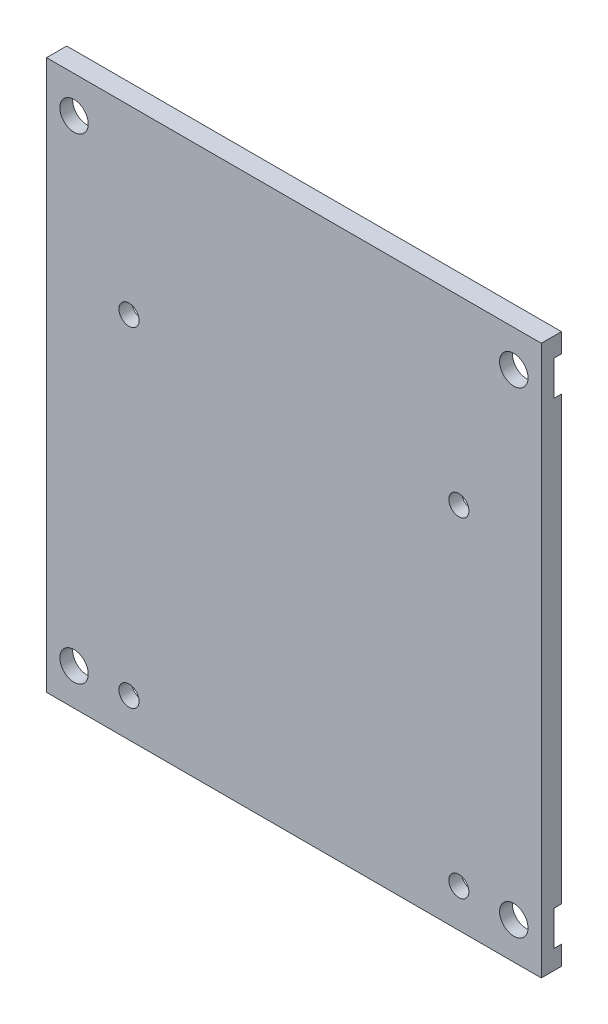
ISO-10303-21;
HEADER;
FILE_DESCRIPTION(('STEP AP214'),'2;1');
FILE_NAME('part.step','',(''),(''),'','','');
FILE_SCHEMA(('AUTOMOTIVE_DESIGN { 1 0 10303 214 1 1 1 1 }'));
ENDSEC;
DATA;
#1=APPLICATION_CONTEXT('core data for automotive mechanical design processes');
#2=APPLICATION_PROTOCOL_DEFINITION('international standard','automotive_design',2000,#1);
#3=PRODUCT_CONTEXT('',#1,'mechanical');
#4=PRODUCT('Part','Part','',(#3));
#5=PRODUCT_RELATED_PRODUCT_CATEGORY('part','',(#4));
#6=PRODUCT_DEFINITION_FORMATION('','',#4);
#7=PRODUCT_DEFINITION_CONTEXT('part definition',#1,'design');
#8=PRODUCT_DEFINITION('design','',#6,#7);
#9=PRODUCT_DEFINITION_SHAPE('','',#8);
#10=(LENGTH_UNIT() NAMED_UNIT(*) SI_UNIT(.MILLI.,.METRE.));
#11=(NAMED_UNIT(*) PLANE_ANGLE_UNIT() SI_UNIT($,.RADIAN.));
#12=(NAMED_UNIT(*) SI_UNIT($,.STERADIAN.) SOLID_ANGLE_UNIT());
#13=UNCERTAINTY_MEASURE_WITH_UNIT(LENGTH_MEASURE(1.E-05),#10,'distance_accuracy_value','');
#14=(GEOMETRIC_REPRESENTATION_CONTEXT(3) GLOBAL_UNCERTAINTY_ASSIGNED_CONTEXT((#13)) GLOBAL_UNIT_ASSIGNED_CONTEXT((#10,
#11,#12)) REPRESENTATION_CONTEXT('',''));
#15=CARTESIAN_POINT('',(0.,0.,0.));
#16=DIRECTION('',(0.,0.,1.));
#17=DIRECTION('',(1.,0.,0.));
#18=AXIS2_PLACEMENT_3D('',#15,#16,#17);
#19=CARTESIAN_POINT('',(-24.,-26.,0.));
#20=DIRECTION('',(0.,0.,1.));
#21=DIRECTION('',(1.,0.,0.));
#22=AXIS2_PLACEMENT_3D('',#19,#20,#21);
#23=CYLINDRICAL_SURFACE('',#22,1.55);
#24=CARTESIAN_POINT('',(-24.,-26.,2.2));
#25=DIRECTION('',(0.,0.,1.));
#26=DIRECTION('',(1.,0.,0.));
#27=AXIS2_PLACEMENT_3D('',#24,#25,#26);
#28=CIRCLE('',#27,1.55);
#29=CARTESIAN_POINT('',(-22.45,-26.,2.2));
#30=VERTEX_POINT('',#29);
#31=EDGE_CURVE('E390',#30,#30,#28,.T.);
#32=ORIENTED_EDGE('',*,*,#31,.T.);
#33=EDGE_LOOP('',(#32));
#34=FACE_BOUND('',#33,.T.);
#35=CARTESIAN_POINT('',(-24.,-26.,0.8));
#36=DIRECTION('',(0.,0.,-1.));
#37=DIRECTION('',(-1.,0.,0.));
#38=AXIS2_PLACEMENT_3D('',#35,#36,#37);
#39=CIRCLE('',#38,1.55);
#40=CARTESIAN_POINT('',(-25.55,-26.,0.8));
#41=VERTEX_POINT('',#40);
#42=EDGE_CURVE('E341',#41,#41,#39,.T.);
#43=ORIENTED_EDGE('',*,*,#42,.T.);
#44=EDGE_LOOP('',(#43));
#45=FACE_BOUND('',#44,.T.);
#46=ADVANCED_FACE('F46',(#34,#45),#23,.F.);
#47=CARTESIAN_POINT('',(-24.,26.,0.));
#48=DIRECTION('',(0.,0.,1.));
#49=DIRECTION('',(1.,0.,0.));
#50=AXIS2_PLACEMENT_3D('',#47,#48,#49);
#51=CYLINDRICAL_SURFACE('',#50,1.55);
#52=CARTESIAN_POINT('',(-24.,26.,2.2));
#53=DIRECTION('',(0.,0.,1.));
#54=DIRECTION('',(1.,0.,0.));
#55=AXIS2_PLACEMENT_3D('',#52,#53,#54);
#56=CIRCLE('',#55,1.55);
#57=CARTESIAN_POINT('',(-22.45,26.,2.2));
#58=VERTEX_POINT('',#57);
#59=EDGE_CURVE('E395',#58,#58,#56,.T.);
#60=ORIENTED_EDGE('',*,*,#59,.T.);
#61=EDGE_LOOP('',(#60));
#62=FACE_BOUND('',#61,.T.);
#63=CARTESIAN_POINT('',(-24.,26.,0.8));
#64=DIRECTION('',(0.,0.,-1.));
#65=DIRECTION('',(-1.,0.,0.));
#66=AXIS2_PLACEMENT_3D('',#63,#64,#65);
#67=CIRCLE('',#66,1.55);
#68=CARTESIAN_POINT('',(-25.55,26.,0.8));
#69=VERTEX_POINT('',#68);
#70=EDGE_CURVE('E351',#69,#69,#67,.T.);
#71=ORIENTED_EDGE('',*,*,#70,.T.);
#72=EDGE_LOOP('',(#71));
#73=FACE_BOUND('',#72,.T.);
#74=ADVANCED_FACE('F429',(#62,#73),#51,.F.);
#75=CARTESIAN_POINT('',(24.,-26.,0.));
#76=DIRECTION('',(0.,0.,1.));
#77=DIRECTION('',(1.,0.,0.));
#78=AXIS2_PLACEMENT_3D('',#75,#76,#77);
#79=CYLINDRICAL_SURFACE('',#78,1.55);
#80=CARTESIAN_POINT('',(24.,-26.,2.2));
#81=DIRECTION('',(0.,0.,1.));
#82=DIRECTION('',(-1.,0.,0.));
#83=AXIS2_PLACEMENT_3D('',#80,#81,#82);
#84=CIRCLE('',#83,1.55);
#85=CARTESIAN_POINT('',(22.45,-26.,2.2));
#86=VERTEX_POINT('',#85);
#87=EDGE_CURVE('E399',#86,#86,#84,.T.);
#88=ORIENTED_EDGE('',*,*,#87,.T.);
#89=EDGE_LOOP('',(#88));
#90=FACE_BOUND('',#89,.T.);
#91=CARTESIAN_POINT('',(24.,-26.,0.8));
#92=DIRECTION('',(0.,0.,-1.));
#93=DIRECTION('',(-1.,0.,0.));
#94=AXIS2_PLACEMENT_3D('',#91,#92,#93);
#95=CIRCLE('',#94,1.55);
#96=CARTESIAN_POINT('',(22.45,-26.,0.8));
#97=VERTEX_POINT('',#96);
#98=EDGE_CURVE('E264',#97,#97,#95,.T.);
#99=ORIENTED_EDGE('',*,*,#98,.T.);
#100=EDGE_LOOP('',(#99));
#101=FACE_BOUND('',#100,.T.);
#102=ADVANCED_FACE('F435',(#90,#101),#79,.F.);
#103=CARTESIAN_POINT('',(24.,26.,0.));
#104=DIRECTION('',(0.,0.,1.));
#105=DIRECTION('',(1.,0.,0.));
#106=AXIS2_PLACEMENT_3D('',#103,#104,#105);
#107=CYLINDRICAL_SURFACE('',#106,1.55);
#108=CARTESIAN_POINT('',(24.,26.,2.2));
#109=DIRECTION('',(0.,0.,1.));
#110=DIRECTION('',(-1.,0.,0.));
#111=AXIS2_PLACEMENT_3D('',#108,#109,#110);
#112=CIRCLE('',#111,1.55);
#113=CARTESIAN_POINT('',(22.45,26.,2.2));
#114=VERTEX_POINT('',#113);
#115=EDGE_CURVE('E389',#114,#114,#112,.T.);
#116=ORIENTED_EDGE('',*,*,#115,.T.);
#117=EDGE_LOOP('',(#116));
#118=FACE_BOUND('',#117,.T.);
#119=CARTESIAN_POINT('',(24.,26.,0.8));
#120=DIRECTION('',(0.,0.,-1.));
#121=DIRECTION('',(-1.,0.,0.));
#122=AXIS2_PLACEMENT_3D('',#119,#120,#121);
#123=CIRCLE('',#122,1.55);
#124=CARTESIAN_POINT('',(22.45,26.,0.8));
#125=VERTEX_POINT('',#124);
#126=EDGE_CURVE('E168',#125,#125,#123,.T.);
#127=ORIENTED_EDGE('',*,*,#126,.T.);
#128=EDGE_LOOP('',(#127));
#129=FACE_BOUND('',#128,.T.);
#130=ADVANCED_FACE('F444',(#118,#129),#107,.F.);
#131=CARTESIAN_POINT('',(-18.,-25.8,2.2));
#132=DIRECTION('',(0.,0.,-1.));
#133=DIRECTION('',(-1.,0.,0.));
#134=AXIS2_PLACEMENT_3D('',#131,#132,#133);
#135=CYLINDRICAL_SURFACE('',#134,1.1);
#136=CARTESIAN_POINT('',(-18.,-25.8,2.2));
#137=DIRECTION('',(0.,0.,1.));
#138=DIRECTION('',(1.,0.,0.));
#139=AXIS2_PLACEMENT_3D('',#136,#137,#138);
#140=CIRCLE('',#139,1.1);
#141=CARTESIAN_POINT('',(-16.9,-25.8,2.2));
#142=VERTEX_POINT('',#141);
#143=EDGE_CURVE('E183',#142,#142,#140,.T.);
#144=ORIENTED_EDGE('',*,*,#143,.T.);
#145=EDGE_LOOP('',(#144));
#146=FACE_BOUND('',#145,.T.);
#147=CARTESIAN_POINT('',(-18.,-25.8,0.8));
#148=DIRECTION('',(0.,0.,-1.));
#149=DIRECTION('',(-1.,0.,0.));
#150=AXIS2_PLACEMENT_3D('',#147,#148,#149);
#151=CIRCLE('',#150,1.1);
#152=CARTESIAN_POINT('',(-19.1,-25.8,0.8));
#153=VERTEX_POINT('',#152);
#154=EDGE_CURVE('E242',#153,#153,#151,.T.);
#155=ORIENTED_EDGE('',*,*,#154,.T.);
#156=EDGE_LOOP('',(#155));
#157=FACE_BOUND('',#156,.T.);
#158=ADVANCED_FACE('F447',(#146,#157),#135,.F.);
#159=CARTESIAN_POINT('',(18.,-25.8,2.2));
#160=DIRECTION('',(0.,0.,-1.));
#161=DIRECTION('',(-1.,0.,0.));
#162=AXIS2_PLACEMENT_3D('',#159,#160,#161);
#163=CYLINDRICAL_SURFACE('',#162,1.1);
#164=CARTESIAN_POINT('',(18.,-25.8,2.2));
#165=DIRECTION('',(0.,0.,1.));
#166=DIRECTION('',(1.,0.,0.));
#167=AXIS2_PLACEMENT_3D('',#164,#165,#166);
#168=CIRCLE('',#167,1.1);
#169=CARTESIAN_POINT('',(19.1,-25.8,2.2));
#170=VERTEX_POINT('',#169);
#171=EDGE_CURVE('E189',#170,#170,#168,.T.);
#172=ORIENTED_EDGE('',*,*,#171,.T.);
#173=EDGE_LOOP('',(#172));
#174=FACE_BOUND('',#173,.T.);
#175=CARTESIAN_POINT('',(18.,-25.8,0.8));
#176=DIRECTION('',(0.,0.,-1.));
#177=DIRECTION('',(-1.,0.,0.));
#178=AXIS2_PLACEMENT_3D('',#175,#176,#177);
#179=CIRCLE('',#178,1.1);
#180=CARTESIAN_POINT('',(16.9,-25.8,0.8));
#181=VERTEX_POINT('',#180);
#182=EDGE_CURVE('E238',#181,#181,#179,.T.);
#183=ORIENTED_EDGE('',*,*,#182,.T.);
#184=EDGE_LOOP('',(#183));
#185=FACE_BOUND('',#184,.T.);
#186=ADVANCED_FACE('F484',(#174,#185),#163,.F.);
#187=CARTESIAN_POINT('',(-18.,10.2,2.2));
#188=DIRECTION('',(0.,0.,-1.));
#189=DIRECTION('',(-1.,0.,0.));
#190=AXIS2_PLACEMENT_3D('',#187,#188,#189);
#191=CYLINDRICAL_SURFACE('',#190,1.1);
#192=CARTESIAN_POINT('',(-18.,10.2,2.2));
#193=DIRECTION('',(0.,0.,1.));
#194=DIRECTION('',(1.,0.,0.));
#195=AXIS2_PLACEMENT_3D('',#192,#193,#194);
#196=CIRCLE('',#195,1.1);
#197=CARTESIAN_POINT('',(-16.9,10.2,2.2));
#198=VERTEX_POINT('',#197);
#199=EDGE_CURVE('E299',#198,#198,#196,.T.);
#200=ORIENTED_EDGE('',*,*,#199,.T.);
#201=EDGE_LOOP('',(#200));
#202=FACE_BOUND('',#201,.T.);
#203=CARTESIAN_POINT('',(-18.,10.2,0.8));
#204=DIRECTION('',(0.,0.,-1.));
#205=DIRECTION('',(-1.,0.,0.));
#206=AXIS2_PLACEMENT_3D('',#203,#204,#205);
#207=CIRCLE('',#206,1.1);
#208=CARTESIAN_POINT('',(-19.1,10.2,0.8));
#209=VERTEX_POINT('',#208);
#210=EDGE_CURVE('E233',#209,#209,#207,.T.);
#211=ORIENTED_EDGE('',*,*,#210,.T.);
#212=EDGE_LOOP('',(#211));
#213=FACE_BOUND('',#212,.T.);
#214=ADVANCED_FACE('F480',(#202,#213),#191,.F.);
#215=CARTESIAN_POINT('',(18.,10.2,2.2));
#216=DIRECTION('',(0.,0.,-1.));
#217=DIRECTION('',(-1.,0.,0.));
#218=AXIS2_PLACEMENT_3D('',#215,#216,#217);
#219=CYLINDRICAL_SURFACE('',#218,1.1);
#220=CARTESIAN_POINT('',(18.,10.2,2.2));
#221=DIRECTION('',(0.,0.,1.));
#222=DIRECTION('',(1.,0.,0.));
#223=AXIS2_PLACEMENT_3D('',#220,#221,#222);
#224=CIRCLE('',#223,1.1);
#225=CARTESIAN_POINT('',(19.1,10.2,2.2));
#226=VERTEX_POINT('',#225);
#227=EDGE_CURVE('E246',#226,#226,#224,.T.);
#228=ORIENTED_EDGE('',*,*,#227,.T.);
#229=EDGE_LOOP('',(#228));
#230=FACE_BOUND('',#229,.T.);
#231=CARTESIAN_POINT('',(18.,10.2,0.8));
#232=DIRECTION('',(0.,0.,-1.));
#233=DIRECTION('',(-1.,0.,0.));
#234=AXIS2_PLACEMENT_3D('',#231,#232,#233);
#235=CIRCLE('',#234,1.1);
#236=CARTESIAN_POINT('',(16.9,10.2,0.8));
#237=VERTEX_POINT('',#236);
#238=EDGE_CURVE('E229',#237,#237,#235,.T.);
#239=ORIENTED_EDGE('',*,*,#238,.T.);
#240=EDGE_LOOP('',(#239));
#241=FACE_BOUND('',#240,.T.);
#242=ADVANCED_FACE('F424',(#230,#241),#219,.F.);
#243=CARTESIAN_POINT('',(0.,0.,2.2));
#244=DIRECTION('',(0.,0.,1.));
#245=DIRECTION('',(1.,0.,0.));
#246=AXIS2_PLACEMENT_3D('',#243,#244,#245);
#247=PLANE('',#246);
#248=ORIENTED_EDGE('',*,*,#115,.F.);
#249=EDGE_LOOP('',(#248));
#250=FACE_BOUND('',#249,.T.);
#251=ORIENTED_EDGE('',*,*,#87,.F.);
#252=EDGE_LOOP('',(#251));
#253=FACE_BOUND('',#252,.T.);
#254=ORIENTED_EDGE('',*,*,#59,.F.);
#255=EDGE_LOOP('',(#254));
#256=FACE_BOUND('',#255,.T.);
#257=ORIENTED_EDGE('',*,*,#31,.F.);
#258=EDGE_LOOP('',(#257));
#259=FACE_BOUND('',#258,.T.);
#260=ORIENTED_EDGE('',*,*,#199,.F.);
#261=EDGE_LOOP('',(#260));
#262=FACE_BOUND('',#261,.T.);
#263=ORIENTED_EDGE('',*,*,#143,.F.);
#264=EDGE_LOOP('',(#263));
#265=FACE_BOUND('',#264,.T.);
#266=DIRECTION('',(0.,1.,0.));
#267=VECTOR('',#266,1.);
#268=CARTESIAN_POINT('',(27.,30.,2.2));
#269=LINE('',#268,#267);
#270=CARTESIAN_POINT('',(27.,-30.,2.2));
#271=VERTEX_POINT('',#270);
#272=CARTESIAN_POINT('',(27.,30.,2.2));
#273=VERTEX_POINT('',#272);
#274=EDGE_CURVE('E213',#271,#273,#269,.T.);
#275=ORIENTED_EDGE('',*,*,#274,.T.);
#276=DIRECTION('',(-1.,0.,0.));
#277=VECTOR('',#276,1.);
#278=CARTESIAN_POINT('',(-27.,30.,2.2));
#279=LINE('',#278,#277);
#280=CARTESIAN_POINT('',(-27.,30.,2.2));
#281=VERTEX_POINT('',#280);
#282=EDGE_CURVE('E309',#273,#281,#279,.T.);
#283=ORIENTED_EDGE('',*,*,#282,.T.);
#284=DIRECTION('',(0.,-1.,0.));
#285=VECTOR('',#284,1.);
#286=CARTESIAN_POINT('',(-27.,30.,2.2));
#287=LINE('',#286,#285);
#288=CARTESIAN_POINT('',(-27.,-30.,2.2));
#289=VERTEX_POINT('',#288);
#290=EDGE_CURVE('E312',#281,#289,#287,.T.);
#291=ORIENTED_EDGE('',*,*,#290,.T.);
#292=DIRECTION('',(1.,0.,0.));
#293=VECTOR('',#292,1.);
#294=CARTESIAN_POINT('',(-27.,-30.,2.2));
#295=LINE('',#294,#293);
#296=EDGE_CURVE('E218',#289,#271,#295,.T.);
#297=ORIENTED_EDGE('',*,*,#296,.T.);
#298=EDGE_LOOP('',(#275,#283,#291,#297));
#299=FACE_BOUND('',#298,.T.);
#300=ORIENTED_EDGE('',*,*,#171,.F.);
#301=EDGE_LOOP('',(#300));
#302=FACE_BOUND('',#301,.T.);
#303=ORIENTED_EDGE('',*,*,#227,.F.);
#304=EDGE_LOOP('',(#303));
#305=FACE_BOUND('',#304,.T.);
#306=ADVANCED_FACE('F318',(#250,#253,#256,#259,#262,#265,#299,#302,#305),#247,.T.);
#307=CARTESIAN_POINT('',(0.,0.,0.));
#308=DIRECTION('',(0.,0.,1.));
#309=DIRECTION('',(1.,0.,0.));
#310=AXIS2_PLACEMENT_3D('',#307,#308,#309);
#311=PLANE('',#310);
#312=CARTESIAN_POINT('',(-18.,10.2,0.));
#313=DIRECTION('',(0.,0.,-1.));
#314=DIRECTION('',(-1.,0.,0.));
#315=AXIS2_PLACEMENT_3D('',#312,#313,#314);
#316=CIRCLE('',#315,3.);
#317=CARTESIAN_POINT('',(-21.,10.2,0.));
#318=VERTEX_POINT('',#317);
#319=EDGE_CURVE('E283',#318,#318,#316,.T.);
#320=ORIENTED_EDGE('',*,*,#319,.F.);
#321=EDGE_LOOP('',(#320));
#322=FACE_BOUND('',#321,.T.);
#323=DIRECTION('',(0.,1.,0.));
#324=VECTOR('',#323,1.);
#325=CARTESIAN_POINT('',(27.,30.,0.));
#326=LINE('',#325,#324);
#327=CARTESIAN_POINT('',(27.,-24.1019747103897,0.));
#328=VERTEX_POINT('',#327);
#329=CARTESIAN_POINT('',(27.,24.1019747103898,0.));
#330=VERTEX_POINT('',#329);
#331=EDGE_CURVE('E182',#328,#330,#326,.T.);
#332=ORIENTED_EDGE('',*,*,#331,.F.);
#333=CARTESIAN_POINT('',(24.,-26.,0.));
#334=DIRECTION('',(0.,0.,-1.));
#335=DIRECTION('',(-1.,0.,0.));
#336=AXIS2_PLACEMENT_3D('',#333,#334,#335);
#337=CIRCLE('',#336,3.55);
#338=CARTESIAN_POINT('',(20.7057534004929,-24.6769582993587,0.));
#339=VERTEX_POINT('',#338);
#340=EDGE_CURVE('E258',#339,#328,#337,.T.);
#341=ORIENTED_EDGE('',*,*,#340,.F.);
#342=CARTESIAN_POINT('',(18.,-25.8,0.));
#343=DIRECTION('',(0.,0.,-1.));
#344=DIRECTION('',(-1.,0.,0.));
#345=AXIS2_PLACEMENT_3D('',#342,#343,#344);
#346=CIRCLE('',#345,2.92956039802186);
#347=CARTESIAN_POINT('',(20.624960937852,-27.1007321785861,0.));
#348=VERTEX_POINT('',#347);
#349=EDGE_CURVE('E261',#348,#339,#346,.T.);
#350=ORIENTED_EDGE('',*,*,#349,.F.);
#351=CARTESIAN_POINT('',(27.,-27.8980252896102,0.));
#352=VERTEX_POINT('',#351);
#353=EDGE_CURVE('E265',#352,#348,#337,.T.);
#354=ORIENTED_EDGE('',*,*,#353,.F.);
#355=CARTESIAN_POINT('',(27.,-30.,0.));
#356=VERTEX_POINT('',#355);
#357=EDGE_CURVE('E185',#356,#352,#326,.T.);
#358=ORIENTED_EDGE('',*,*,#357,.F.);
#359=DIRECTION('',(1.,0.,0.));
#360=VECTOR('',#359,1.);
#361=CARTESIAN_POINT('',(-27.,-30.,0.));
#362=LINE('',#361,#360);
#363=CARTESIAN_POINT('',(-27.,-30.,0.));
#364=VERTEX_POINT('',#363);
#365=EDGE_CURVE('E210',#364,#356,#362,.T.);
#366=ORIENTED_EDGE('',*,*,#365,.F.);
#367=DIRECTION('',(0.,-1.,0.));
#368=VECTOR('',#367,1.);
#369=CARTESIAN_POINT('',(-27.,30.,0.));
#370=LINE('',#369,#368);
#371=CARTESIAN_POINT('',(-27.,-27.8980252896103,0.));
#372=VERTEX_POINT('',#371);
#373=EDGE_CURVE('E199',#372,#364,#370,.T.);
#374=ORIENTED_EDGE('',*,*,#373,.F.);
#375=CARTESIAN_POINT('',(-24.,-26.,0.));
#376=DIRECTION('',(0.,0.,-1.));
#377=DIRECTION('',(-1.,0.,0.));
#378=AXIS2_PLACEMENT_3D('',#375,#376,#377);
#379=CIRCLE('',#378,3.55);
#380=CARTESIAN_POINT('',(-20.6566719898302,-27.1935903050939,0.));
#381=VERTEX_POINT('',#380);
#382=EDGE_CURVE('E507',#381,#372,#379,.T.);
#383=ORIENTED_EDGE('',*,*,#382,.F.);
#384=CARTESIAN_POINT('',(-18.,-25.8,0.));
#385=DIRECTION('',(0.,0.,-1.));
#386=DIRECTION('',(-1.,0.,0.));
#387=AXIS2_PLACEMENT_3D('',#384,#385,#386);
#388=CIRCLE('',#387,3.);
#389=CARTESIAN_POINT('',(-20.7435777327003,-24.5864180189905,0.));
#390=VERTEX_POINT('',#389);
#391=EDGE_CURVE('E285',#390,#381,#388,.T.);
#392=ORIENTED_EDGE('',*,*,#391,.F.);
#393=CARTESIAN_POINT('',(-27.,-24.1019747103898,0.));
#394=VERTEX_POINT('',#393);
#395=EDGE_CURVE('E502',#394,#390,#379,.T.);
#396=ORIENTED_EDGE('',*,*,#395,.F.);
#397=CARTESIAN_POINT('',(-27.,24.1019747103898,0.));
#398=VERTEX_POINT('',#397);
#399=EDGE_CURVE('E204',#398,#394,#370,.T.);
#400=ORIENTED_EDGE('',*,*,#399,.F.);
#401=CARTESIAN_POINT('',(-24.,26.,0.));
#402=DIRECTION('',(0.,0.,-1.));
#403=DIRECTION('',(-1.,0.,0.));
#404=AXIS2_PLACEMENT_3D('',#401,#402,#403);
#405=CIRCLE('',#404,3.55);
#406=CARTESIAN_POINT('',(-27.,27.8980252896102,0.));
#407=VERTEX_POINT('',#406);
#408=EDGE_CURVE('E505',#407,#398,#405,.T.);
#409=ORIENTED_EDGE('',*,*,#408,.F.);
#410=CARTESIAN_POINT('',(-27.,30.,0.));
#411=VERTEX_POINT('',#410);
#412=EDGE_CURVE('E206',#411,#407,#370,.T.);
#413=ORIENTED_EDGE('',*,*,#412,.F.);
#414=DIRECTION('',(-1.,0.,0.));
#415=VECTOR('',#414,1.);
#416=CARTESIAN_POINT('',(-27.,30.,0.));
#417=LINE('',#416,#415);
#418=CARTESIAN_POINT('',(27.,30.,0.));
#419=VERTEX_POINT('',#418);
#420=EDGE_CURVE('E179',#419,#411,#417,.T.);
#421=ORIENTED_EDGE('',*,*,#420,.F.);
#422=CARTESIAN_POINT('',(27.,27.8980252896102,0.));
#423=VERTEX_POINT('',#422);
#424=EDGE_CURVE('E173',#423,#419,#326,.T.);
#425=ORIENTED_EDGE('',*,*,#424,.F.);
#426=CARTESIAN_POINT('',(24.,26.,0.));
#427=DIRECTION('',(0.,0.,-1.));
#428=DIRECTION('',(-1.,0.,0.));
#429=AXIS2_PLACEMENT_3D('',#426,#427,#428);
#430=CIRCLE('',#429,3.55);
#431=EDGE_CURVE('E159',#330,#423,#430,.T.);
#432=ORIENTED_EDGE('',*,*,#431,.F.);
#433=EDGE_LOOP('',(#332,#341,#350,#354,#358,#366,#374,#383,#392,#396,#400,#409,#413,#421,#425,#432));
#434=FACE_BOUND('',#433,.T.);
#435=CARTESIAN_POINT('',(18.,10.2,0.));
#436=DIRECTION('',(0.,0.,-1.));
#437=DIRECTION('',(-1.,0.,0.));
#438=AXIS2_PLACEMENT_3D('',#435,#436,#437);
#439=CIRCLE('',#438,3.);
#440=CARTESIAN_POINT('',(15.,10.2,0.));
#441=VERTEX_POINT('',#440);
#442=EDGE_CURVE('E292',#441,#441,#439,.T.);
#443=ORIENTED_EDGE('',*,*,#442,.F.);
#444=EDGE_LOOP('',(#443));
#445=FACE_BOUND('',#444,.T.);
#446=ADVANCED_FACE('F176',(#322,#434,#445),#311,.F.);
#447=CARTESIAN_POINT('',(27.,30.,2.2));
#448=DIRECTION('',(-1.,0.,0.));
#449=DIRECTION('',(0.,-1.,0.));
#450=AXIS2_PLACEMENT_3D('',#447,#448,#449);
#451=PLANE('',#450);
#452=DIRECTION('',(0.,-1.,0.));
#453=VECTOR('',#452,1.);
#454=CARTESIAN_POINT('',(27.,30.,0.8));
#455=LINE('',#454,#453);
#456=CARTESIAN_POINT('',(27.,-24.1019747103897,0.8));
#457=VERTEX_POINT('',#456);
#458=CARTESIAN_POINT('',(27.,-27.8980252896102,0.8));
#459=VERTEX_POINT('',#458);
#460=EDGE_CURVE('E356',#457,#459,#455,.T.);
#461=ORIENTED_EDGE('',*,*,#460,.F.);
#462=DIRECTION('',(0.,0.,-1.));
#463=VECTOR('',#462,1.);
#464=CARTESIAN_POINT('',(27.,-24.1019747103897,0.8));
#465=LINE('',#464,#463);
#466=EDGE_CURVE('E255',#457,#328,#465,.T.);
#467=ORIENTED_EDGE('',*,*,#466,.T.);
#468=ORIENTED_EDGE('',*,*,#331,.T.);
#469=DIRECTION('',(0.,0.,-1.));
#470=VECTOR('',#469,1.);
#471=CARTESIAN_POINT('',(27.,24.1019747103898,0.8));
#472=LINE('',#471,#470);
#473=CARTESIAN_POINT('',(27.,24.1019747103898,0.8));
#474=VERTEX_POINT('',#473);
#475=EDGE_CURVE('E55',#330,#474,#472,.F.);
#476=ORIENTED_EDGE('',*,*,#475,.T.);
#477=DIRECTION('',(0.,-1.,0.));
#478=VECTOR('',#477,1.);
#479=CARTESIAN_POINT('',(27.,30.,0.8));
#480=LINE('',#479,#478);
#481=CARTESIAN_POINT('',(27.,27.8980252896102,0.8));
#482=VERTEX_POINT('',#481);
#483=EDGE_CURVE('E175',#482,#474,#480,.T.);
#484=ORIENTED_EDGE('',*,*,#483,.F.);
#485=DIRECTION('',(0.,0.,-1.));
#486=VECTOR('',#485,1.);
#487=CARTESIAN_POINT('',(27.,27.8980252896102,0.8));
#488=LINE('',#487,#486);
#489=EDGE_CURVE('E12',#482,#423,#488,.T.);
#490=ORIENTED_EDGE('',*,*,#489,.T.);
#491=ORIENTED_EDGE('',*,*,#424,.T.);
#492=DIRECTION('',(0.,0.,-1.));
#493=VECTOR('',#492,1.);
#494=CARTESIAN_POINT('',(27.,30.,2.2));
#495=LINE('',#494,#493);
#496=EDGE_CURVE('E225',#273,#419,#495,.T.);
#497=ORIENTED_EDGE('',*,*,#496,.F.);
#498=ORIENTED_EDGE('',*,*,#274,.F.);
#499=DIRECTION('',(0.,0.,-1.));
#500=VECTOR('',#499,1.);
#501=CARTESIAN_POINT('',(27.,-30.,2.2));
#502=LINE('',#501,#500);
#503=EDGE_CURVE('E214',#271,#356,#502,.T.);
#504=ORIENTED_EDGE('',*,*,#503,.T.);
#505=ORIENTED_EDGE('',*,*,#357,.T.);
#506=DIRECTION('',(0.,0.,-1.));
#507=VECTOR('',#506,1.);
#508=CARTESIAN_POINT('',(27.,-27.8980252896102,0.8));
#509=LINE('',#508,#507);
#510=EDGE_CURVE('E384',#352,#459,#509,.F.);
#511=ORIENTED_EDGE('',*,*,#510,.T.);
#512=EDGE_LOOP('',(#461,#467,#468,#476,#484,#490,#491,#497,#498,#504,#505,#511));
#513=FACE_BOUND('',#512,.T.);
#514=ADVANCED_FACE('F48',(#513),#451,.F.);
#515=CARTESIAN_POINT('',(-27.,30.,2.2));
#516=DIRECTION('',(0.,-1.,0.));
#517=DIRECTION('',(0.,0.,-1.));
#518=AXIS2_PLACEMENT_3D('',#515,#516,#517);
#519=PLANE('',#518);
#520=ORIENTED_EDGE('',*,*,#420,.T.);
#521=DIRECTION('',(0.,0.,-1.));
#522=VECTOR('',#521,1.);
#523=CARTESIAN_POINT('',(-27.,30.,2.2));
#524=LINE('',#523,#522);
#525=EDGE_CURVE('E222',#281,#411,#524,.T.);
#526=ORIENTED_EDGE('',*,*,#525,.F.);
#527=ORIENTED_EDGE('',*,*,#282,.F.);
#528=ORIENTED_EDGE('',*,*,#496,.T.);
#529=EDGE_LOOP('',(#520,#526,#527,#528));
#530=FACE_BOUND('',#529,.T.);
#531=ADVANCED_FACE('F326',(#530),#519,.F.);
#532=CARTESIAN_POINT('',(-27.,30.,2.2));
#533=DIRECTION('',(1.,0.,0.));
#534=DIRECTION('',(0.,1.,0.));
#535=AXIS2_PLACEMENT_3D('',#532,#533,#534);
#536=PLANE('',#535);
#537=DIRECTION('',(0.,1.,0.));
#538=VECTOR('',#537,1.);
#539=CARTESIAN_POINT('',(-27.,30.,0.8));
#540=LINE('',#539,#538);
#541=CARTESIAN_POINT('',(-27.,-27.8980252896103,0.8));
#542=VERTEX_POINT('',#541);
#543=CARTESIAN_POINT('',(-27.,-24.1019747103898,0.8));
#544=VERTEX_POINT('',#543);
#545=EDGE_CURVE('E362',#542,#544,#540,.T.);
#546=ORIENTED_EDGE('',*,*,#545,.F.);
#547=DIRECTION('',(0.,0.,-1.));
#548=VECTOR('',#547,1.);
#549=CARTESIAN_POINT('',(-27.,-27.8980252896103,0.8));
#550=LINE('',#549,#548);
#551=EDGE_CURVE('E377',#542,#372,#550,.T.);
#552=ORIENTED_EDGE('',*,*,#551,.T.);
#553=ORIENTED_EDGE('',*,*,#373,.T.);
#554=DIRECTION('',(0.,0.,-1.));
#555=VECTOR('',#554,1.);
#556=CARTESIAN_POINT('',(-27.,-30.,2.2));
#557=LINE('',#556,#555);
#558=EDGE_CURVE('E217',#289,#364,#557,.T.);
#559=ORIENTED_EDGE('',*,*,#558,.F.);
#560=ORIENTED_EDGE('',*,*,#290,.F.);
#561=ORIENTED_EDGE('',*,*,#525,.T.);
#562=ORIENTED_EDGE('',*,*,#412,.T.);
#563=DIRECTION('',(0.,0.,-1.));
#564=VECTOR('',#563,1.);
#565=CARTESIAN_POINT('',(-27.,27.8980252896102,0.8));
#566=LINE('',#565,#564);
#567=CARTESIAN_POINT('',(-27.,27.8980252896102,0.8));
#568=VERTEX_POINT('',#567);
#569=EDGE_CURVE('E228',#407,#568,#566,.F.);
#570=ORIENTED_EDGE('',*,*,#569,.T.);
#571=DIRECTION('',(0.,1.,0.));
#572=VECTOR('',#571,1.);
#573=CARTESIAN_POINT('',(-27.,30.,0.8));
#574=LINE('',#573,#572);
#575=CARTESIAN_POINT('',(-27.,24.1019747103898,0.8));
#576=VERTEX_POINT('',#575);
#577=EDGE_CURVE('E359',#576,#568,#574,.T.);
#578=ORIENTED_EDGE('',*,*,#577,.F.);
#579=DIRECTION('',(0.,0.,-1.));
#580=VECTOR('',#579,1.);
#581=CARTESIAN_POINT('',(-27.,24.1019747103898,0.8));
#582=LINE('',#581,#580);
#583=EDGE_CURVE('E250',#576,#398,#582,.T.);
#584=ORIENTED_EDGE('',*,*,#583,.T.);
#585=ORIENTED_EDGE('',*,*,#399,.T.);
#586=DIRECTION('',(0.,0.,-1.));
#587=VECTOR('',#586,1.);
#588=CARTESIAN_POINT('',(-27.,-24.1019747103898,0.8));
#589=LINE('',#588,#587);
#590=EDGE_CURVE('E373',#394,#544,#589,.F.);
#591=ORIENTED_EDGE('',*,*,#590,.T.);
#592=EDGE_LOOP('',(#546,#552,#553,#559,#560,#561,#562,#570,#578,#584,#585,#591));
#593=FACE_BOUND('',#592,.T.);
#594=ADVANCED_FACE('F329',(#593),#536,.F.);
#595=CARTESIAN_POINT('',(-27.,-30.,2.2));
#596=DIRECTION('',(0.,1.,0.));
#597=DIRECTION('',(0.,0.,1.));
#598=AXIS2_PLACEMENT_3D('',#595,#596,#597);
#599=PLANE('',#598);
#600=ORIENTED_EDGE('',*,*,#365,.T.);
#601=ORIENTED_EDGE('',*,*,#503,.F.);
#602=ORIENTED_EDGE('',*,*,#296,.F.);
#603=ORIENTED_EDGE('',*,*,#558,.T.);
#604=EDGE_LOOP('',(#600,#601,#602,#603));
#605=FACE_BOUND('',#604,.T.);
#606=ADVANCED_FACE('F324',(#605),#599,.F.);
#607=CARTESIAN_POINT('',(18.,10.2,0.8));
#608=DIRECTION('',(0.,0.,-1.));
#609=DIRECTION('',(-1.,0.,0.));
#610=AXIS2_PLACEMENT_3D('',#607,#608,#609);
#611=CYLINDRICAL_SURFACE('',#610,3.);
#612=CARTESIAN_POINT('',(18.,10.2,0.8));
#613=DIRECTION('',(0.,0.,-1.));
#614=DIRECTION('',(-1.,0.,0.));
#615=AXIS2_PLACEMENT_3D('',#612,#613,#614);
#616=CIRCLE('',#615,3.);
#617=CARTESIAN_POINT('',(15.,10.2,0.8));
#618=VERTEX_POINT('',#617);
#619=EDGE_CURVE('E234',#618,#618,#616,.T.);
#620=ORIENTED_EDGE('',*,*,#619,.F.);
#621=EDGE_LOOP('',(#620));
#622=FACE_BOUND('',#621,.T.);
#623=ORIENTED_EDGE('',*,*,#442,.T.);
#624=EDGE_LOOP('',(#623));
#625=FACE_BOUND('',#624,.T.);
#626=ADVANCED_FACE('F473',(#622,#625),#611,.F.);
#627=CARTESIAN_POINT('',(18.,10.2,0.8));
#628=DIRECTION('',(0.,0.,-1.));
#629=DIRECTION('',(-1.,0.,0.));
#630=AXIS2_PLACEMENT_3D('',#627,#628,#629);
#631=PLANE('',#630);
#632=ORIENTED_EDGE('',*,*,#238,.F.);
#633=EDGE_LOOP('',(#632));
#634=FACE_BOUND('',#633,.T.);
#635=ORIENTED_EDGE('',*,*,#619,.T.);
#636=EDGE_LOOP('',(#635));
#637=FACE_BOUND('',#636,.T.);
#638=ADVANCED_FACE('F461',(#634,#637),#631,.T.);
#639=CARTESIAN_POINT('',(-18.,10.2,0.8));
#640=DIRECTION('',(0.,0.,-1.));
#641=DIRECTION('',(-1.,0.,0.));
#642=AXIS2_PLACEMENT_3D('',#639,#640,#641);
#643=CYLINDRICAL_SURFACE('',#642,3.);
#644=CARTESIAN_POINT('',(-18.,10.2,0.8));
#645=DIRECTION('',(0.,0.,-1.));
#646=DIRECTION('',(-1.,0.,0.));
#647=AXIS2_PLACEMENT_3D('',#644,#645,#646);
#648=CIRCLE('',#647,3.);
#649=CARTESIAN_POINT('',(-21.,10.2,0.8));
#650=VERTEX_POINT('',#649);
#651=EDGE_CURVE('E277',#650,#650,#648,.T.);
#652=ORIENTED_EDGE('',*,*,#651,.F.);
#653=EDGE_LOOP('',(#652));
#654=FACE_BOUND('',#653,.T.);
#655=ORIENTED_EDGE('',*,*,#319,.T.);
#656=EDGE_LOOP('',(#655));
#657=FACE_BOUND('',#656,.T.);
#658=ADVANCED_FACE('F415',(#654,#657),#643,.F.);
#659=CARTESIAN_POINT('',(-18.,10.2,0.8));
#660=DIRECTION('',(0.,0.,-1.));
#661=DIRECTION('',(-1.,0.,0.));
#662=AXIS2_PLACEMENT_3D('',#659,#660,#661);
#663=PLANE('',#662);
#664=ORIENTED_EDGE('',*,*,#210,.F.);
#665=EDGE_LOOP('',(#664));
#666=FACE_BOUND('',#665,.T.);
#667=ORIENTED_EDGE('',*,*,#651,.T.);
#668=EDGE_LOOP('',(#667));
#669=FACE_BOUND('',#668,.T.);
#670=ADVANCED_FACE('F460',(#666,#669),#663,.T.);
#671=CARTESIAN_POINT('',(18.,-25.8,0.8));
#672=DIRECTION('',(0.,0.,-1.));
#673=DIRECTION('',(-1.,0.,0.));
#674=AXIS2_PLACEMENT_3D('',#671,#672,#673);
#675=CYLINDRICAL_SURFACE('',#674,2.92956039802186);
#676=CARTESIAN_POINT('',(18.,-25.8,0.8));
#677=DIRECTION('',(0.,0.,-1.));
#678=DIRECTION('',(-1.,0.,0.));
#679=AXIS2_PLACEMENT_3D('',#676,#677,#678);
#680=CIRCLE('',#679,2.92956039802186);
#681=CARTESIAN_POINT('',(20.624960937852,-27.1007321785861,0.8));
#682=VERTEX_POINT('',#681);
#683=CARTESIAN_POINT('',(20.7057534004929,-24.6769582993587,0.8));
#684=VERTEX_POINT('',#683);
#685=EDGE_CURVE('E278',#682,#684,#680,.T.);
#686=ORIENTED_EDGE('',*,*,#685,.F.);
#687=DIRECTION('',(0.,0.,-1.));
#688=VECTOR('',#687,1.);
#689=CARTESIAN_POINT('',(20.624960937852,-27.1007321785861,0.4));
#690=LINE('',#689,#688);
#691=EDGE_CURVE('E275',#682,#348,#690,.T.);
#692=ORIENTED_EDGE('',*,*,#691,.T.);
#693=ORIENTED_EDGE('',*,*,#349,.T.);
#694=DIRECTION('',(0.,0.,-1.));
#695=VECTOR('',#694,1.);
#696=CARTESIAN_POINT('',(20.7057534004929,-24.6769582993587,0.4));
#697=LINE('',#696,#695);
#698=EDGE_CURVE('E272',#339,#684,#697,.F.);
#699=ORIENTED_EDGE('',*,*,#698,.T.);
#700=EDGE_LOOP('',(#686,#692,#693,#699));
#701=FACE_BOUND('',#700,.T.);
#702=ADVANCED_FACE('F271',(#701),#675,.F.);
#703=CARTESIAN_POINT('',(18.,-25.8,0.8));
#704=DIRECTION('',(0.,0.,-1.));
#705=DIRECTION('',(-1.,0.,0.));
#706=AXIS2_PLACEMENT_3D('',#703,#704,#705);
#707=PLANE('',#706);
#708=ORIENTED_EDGE('',*,*,#685,.T.);
#709=CARTESIAN_POINT('',(24.,-26.,0.8));
#710=DIRECTION('',(0.,0.,-1.));
#711=DIRECTION('',(-1.,0.,0.));
#712=AXIS2_PLACEMENT_3D('',#709,#710,#711);
#713=CIRCLE('',#712,3.55);
#714=EDGE_CURVE('E335',#684,#457,#713,.T.);
#715=ORIENTED_EDGE('',*,*,#714,.T.);
#716=ORIENTED_EDGE('',*,*,#460,.T.);
#717=EDGE_CURVE('E338',#459,#682,#713,.T.);
#718=ORIENTED_EDGE('',*,*,#717,.T.);
#719=EDGE_LOOP('',(#708,#715,#716,#718));
#720=FACE_BOUND('',#719,.T.);
#721=ORIENTED_EDGE('',*,*,#182,.F.);
#722=EDGE_LOOP('',(#721));
#723=FACE_BOUND('',#722,.T.);
#724=ORIENTED_EDGE('',*,*,#98,.F.);
#725=EDGE_LOOP('',(#724));
#726=FACE_BOUND('',#725,.T.);
#727=ADVANCED_FACE('F453',(#720,#723,#726),#707,.T.);
#728=CARTESIAN_POINT('',(-18.,-25.8,0.8));
#729=DIRECTION('',(0.,0.,-1.));
#730=DIRECTION('',(-1.,0.,0.));
#731=AXIS2_PLACEMENT_3D('',#728,#729,#730);
#732=CYLINDRICAL_SURFACE('',#731,3.);
#733=CARTESIAN_POINT('',(-18.,-25.8,0.8));
#734=DIRECTION('',(0.,0.,-1.));
#735=DIRECTION('',(-1.,0.,0.));
#736=AXIS2_PLACEMENT_3D('',#733,#734,#735);
#737=CIRCLE('',#736,3.);
#738=CARTESIAN_POINT('',(-20.7435777327003,-24.5864180189905,0.8));
#739=VERTEX_POINT('',#738);
#740=CARTESIAN_POINT('',(-20.6566719898302,-27.1935903050939,0.8));
#741=VERTEX_POINT('',#740);
#742=EDGE_CURVE('E394',#739,#741,#737,.T.);
#743=ORIENTED_EDGE('',*,*,#742,.F.);
#744=DIRECTION('',(0.,0.,-1.));
#745=VECTOR('',#744,1.);
#746=CARTESIAN_POINT('',(-20.7435777327003,-24.5864180189905,0.4));
#747=LINE('',#746,#745);
#748=EDGE_CURVE('E369',#739,#390,#747,.T.);
#749=ORIENTED_EDGE('',*,*,#748,.T.);
#750=ORIENTED_EDGE('',*,*,#391,.T.);
#751=DIRECTION('',(0.,0.,-1.));
#752=VECTOR('',#751,1.);
#753=CARTESIAN_POINT('',(-20.6566719898302,-27.1935903050939,0.4));
#754=LINE('',#753,#752);
#755=EDGE_CURVE('E365',#381,#741,#754,.F.);
#756=ORIENTED_EDGE('',*,*,#755,.T.);
#757=EDGE_LOOP('',(#743,#749,#750,#756));
#758=FACE_BOUND('',#757,.T.);
#759=ADVANCED_FACE('F449',(#758),#732,.F.);
#760=CARTESIAN_POINT('',(-18.,-25.8,0.8));
#761=DIRECTION('',(0.,0.,-1.));
#762=DIRECTION('',(-1.,0.,0.));
#763=AXIS2_PLACEMENT_3D('',#760,#761,#762);
#764=PLANE('',#763);
#765=ORIENTED_EDGE('',*,*,#742,.T.);
#766=CARTESIAN_POINT('',(-24.,-26.,0.8));
#767=DIRECTION('',(0.,0.,-1.));
#768=DIRECTION('',(-1.,0.,0.));
#769=AXIS2_PLACEMENT_3D('',#766,#767,#768);
#770=CIRCLE('',#769,3.55);
#771=EDGE_CURVE('E347',#741,#542,#770,.T.);
#772=ORIENTED_EDGE('',*,*,#771,.T.);
#773=ORIENTED_EDGE('',*,*,#545,.T.);
#774=EDGE_CURVE('E513',#544,#739,#770,.T.);
#775=ORIENTED_EDGE('',*,*,#774,.T.);
#776=EDGE_LOOP('',(#765,#772,#773,#775));
#777=FACE_BOUND('',#776,.T.);
#778=ORIENTED_EDGE('',*,*,#154,.F.);
#779=EDGE_LOOP('',(#778));
#780=FACE_BOUND('',#779,.T.);
#781=ORIENTED_EDGE('',*,*,#42,.F.);
#782=EDGE_LOOP('',(#781));
#783=FACE_BOUND('',#782,.T.);
#784=ADVANCED_FACE('F452',(#777,#780,#783),#764,.T.);
#785=CARTESIAN_POINT('',(24.,26.,0.8));
#786=DIRECTION('',(0.,0.,-1.));
#787=DIRECTION('',(-1.,0.,0.));
#788=AXIS2_PLACEMENT_3D('',#785,#786,#787);
#789=CYLINDRICAL_SURFACE('',#788,3.55);
#790=CARTESIAN_POINT('',(24.,26.,0.8));
#791=DIRECTION('',(0.,0.,-1.));
#792=DIRECTION('',(-1.,0.,0.));
#793=AXIS2_PLACEMENT_3D('',#790,#791,#792);
#794=CIRCLE('',#793,3.55);
#795=EDGE_CURVE('E61',#474,#482,#794,.T.);
#796=ORIENTED_EDGE('',*,*,#795,.F.);
#797=ORIENTED_EDGE('',*,*,#475,.F.);
#798=ORIENTED_EDGE('',*,*,#431,.T.);
#799=ORIENTED_EDGE('',*,*,#489,.F.);
#800=EDGE_LOOP('',(#796,#797,#798,#799));
#801=FACE_BOUND('',#800,.T.);
#802=ADVANCED_FACE('F160',(#801),#789,.F.);
#803=CARTESIAN_POINT('',(24.,26.,0.8));
#804=DIRECTION('',(0.,0.,-1.));
#805=DIRECTION('',(-1.,0.,0.));
#806=AXIS2_PLACEMENT_3D('',#803,#804,#805);
#807=PLANE('',#806);
#808=ORIENTED_EDGE('',*,*,#126,.F.);
#809=EDGE_LOOP('',(#808));
#810=FACE_BOUND('',#809,.T.);
#811=ORIENTED_EDGE('',*,*,#483,.T.);
#812=ORIENTED_EDGE('',*,*,#795,.T.);
#813=EDGE_LOOP('',(#811,#812));
#814=FACE_BOUND('',#813,.T.);
#815=ADVANCED_FACE('F542',(#810,#814),#807,.T.);
#816=CARTESIAN_POINT('',(24.,-26.,0.8));
#817=DIRECTION('',(0.,0.,-1.));
#818=DIRECTION('',(-1.,0.,0.));
#819=AXIS2_PLACEMENT_3D('',#816,#817,#818);
#820=CYLINDRICAL_SURFACE('',#819,3.55);
#821=ORIENTED_EDGE('',*,*,#714,.F.);
#822=ORIENTED_EDGE('',*,*,#698,.F.);
#823=ORIENTED_EDGE('',*,*,#340,.T.);
#824=ORIENTED_EDGE('',*,*,#466,.F.);
#825=EDGE_LOOP('',(#821,#822,#823,#824));
#826=FACE_BOUND('',#825,.T.);
#827=ADVANCED_FACE('F539',(#826),#820,.F.);
#828=ORIENTED_EDGE('',*,*,#353,.T.);
#829=ORIENTED_EDGE('',*,*,#691,.F.);
#830=ORIENTED_EDGE('',*,*,#717,.F.);
#831=ORIENTED_EDGE('',*,*,#510,.F.);
#832=EDGE_LOOP('',(#828,#829,#830,#831));
#833=FACE_BOUND('',#832,.T.);
#834=ADVANCED_FACE('F541',(#833),#820,.F.);
#835=CARTESIAN_POINT('',(-24.,26.,0.8));
#836=DIRECTION('',(0.,0.,-1.));
#837=DIRECTION('',(-1.,0.,0.));
#838=AXIS2_PLACEMENT_3D('',#835,#836,#837);
#839=CYLINDRICAL_SURFACE('',#838,3.55);
#840=CARTESIAN_POINT('',(-24.,26.,0.8));
#841=DIRECTION('',(0.,0.,-1.));
#842=DIRECTION('',(-1.,0.,0.));
#843=AXIS2_PLACEMENT_3D('',#840,#841,#842);
#844=CIRCLE('',#843,3.55);
#845=EDGE_CURVE('E68',#568,#576,#844,.T.);
#846=ORIENTED_EDGE('',*,*,#845,.F.);
#847=ORIENTED_EDGE('',*,*,#569,.F.);
#848=ORIENTED_EDGE('',*,*,#408,.T.);
#849=ORIENTED_EDGE('',*,*,#583,.F.);
#850=EDGE_LOOP('',(#846,#847,#848,#849));
#851=FACE_BOUND('',#850,.T.);
#852=ADVANCED_FACE('F534',(#851),#839,.F.);
#853=CARTESIAN_POINT('',(-24.,26.,0.8));
#854=DIRECTION('',(0.,0.,-1.));
#855=DIRECTION('',(-1.,0.,0.));
#856=AXIS2_PLACEMENT_3D('',#853,#854,#855);
#857=PLANE('',#856);
#858=ORIENTED_EDGE('',*,*,#70,.F.);
#859=EDGE_LOOP('',(#858));
#860=FACE_BOUND('',#859,.T.);
#861=ORIENTED_EDGE('',*,*,#577,.T.);
#862=ORIENTED_EDGE('',*,*,#845,.T.);
#863=EDGE_LOOP('',(#861,#862));
#864=FACE_BOUND('',#863,.T.);
#865=ADVANCED_FACE('F528',(#860,#864),#857,.T.);
#866=CARTESIAN_POINT('',(-24.,-26.,0.8));
#867=DIRECTION('',(0.,0.,-1.));
#868=DIRECTION('',(-1.,0.,0.));
#869=AXIS2_PLACEMENT_3D('',#866,#867,#868);
#870=CYLINDRICAL_SURFACE('',#869,3.55);
#871=ORIENTED_EDGE('',*,*,#771,.F.);
#872=ORIENTED_EDGE('',*,*,#755,.F.);
#873=ORIENTED_EDGE('',*,*,#382,.T.);
#874=ORIENTED_EDGE('',*,*,#551,.F.);
#875=EDGE_LOOP('',(#871,#872,#873,#874));
#876=FACE_BOUND('',#875,.T.);
#877=ADVANCED_FACE('F526',(#876),#870,.F.);
#878=ORIENTED_EDGE('',*,*,#395,.T.);
#879=ORIENTED_EDGE('',*,*,#748,.F.);
#880=ORIENTED_EDGE('',*,*,#774,.F.);
#881=ORIENTED_EDGE('',*,*,#590,.F.);
#882=EDGE_LOOP('',(#878,#879,#880,#881));
#883=FACE_BOUND('',#882,.T.);
#884=ADVANCED_FACE('F523',(#883),#870,.F.);
#885=CLOSED_SHELL('',(#46,#74,#102,#130,#158,#186,#214,#242,#306,#446,#514,#531,#594,#606,#626,
#638,#658,#670,#702,#727,#759,#784,#802,#815,#827,#834,#852,#865,#877,#884));
#886=MANIFOLD_SOLID_BREP('B2',#885);
#887=ADVANCED_BREP_SHAPE_REPRESENTATION('',(#18,#886),#14);
#888=SHAPE_DEFINITION_REPRESENTATION(#9,#887);
ENDSEC;
END-ISO-10303-21;
